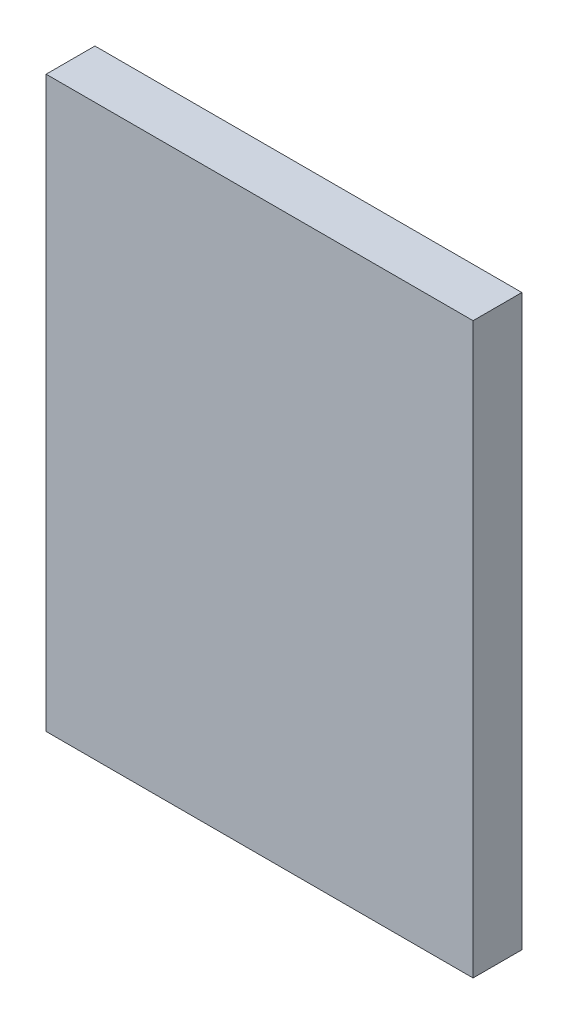
ISO-10303-21;
HEADER;
FILE_DESCRIPTION(('STEP AP214'),'2;1');
FILE_NAME('part.step','',(''),(''),'','','');
FILE_SCHEMA(('AUTOMOTIVE_DESIGN { 1 0 10303 214 1 1 1 1 }'));
ENDSEC;
DATA;
#1=APPLICATION_CONTEXT('core data for automotive mechanical design processes');
#2=APPLICATION_PROTOCOL_DEFINITION('international standard','automotive_design',2000,#1);
#3=PRODUCT_CONTEXT('',#1,'mechanical');
#4=PRODUCT('Part','Part','',(#3));
#5=PRODUCT_RELATED_PRODUCT_CATEGORY('part','',(#4));
#6=PRODUCT_DEFINITION_FORMATION('','',#4);
#7=PRODUCT_DEFINITION_CONTEXT('part definition',#1,'design');
#8=PRODUCT_DEFINITION('design','',#6,#7);
#9=PRODUCT_DEFINITION_SHAPE('','',#8);
#10=(LENGTH_UNIT() NAMED_UNIT(*) SI_UNIT(.MILLI.,.METRE.));
#11=(NAMED_UNIT(*) PLANE_ANGLE_UNIT() SI_UNIT($,.RADIAN.));
#12=(NAMED_UNIT(*) SI_UNIT($,.STERADIAN.) SOLID_ANGLE_UNIT());
#13=UNCERTAINTY_MEASURE_WITH_UNIT(LENGTH_MEASURE(1.E-05),#10,'distance_accuracy_value','');
#14=(GEOMETRIC_REPRESENTATION_CONTEXT(3) GLOBAL_UNCERTAINTY_ASSIGNED_CONTEXT((#13)) GLOBAL_UNIT_ASSIGNED_CONTEXT((#10,
#11,#12)) REPRESENTATION_CONTEXT('',''));
#15=CARTESIAN_POINT('',(0.,0.,0.));
#16=DIRECTION('',(0.,0.,1.));
#17=DIRECTION('',(1.,0.,0.));
#18=AXIS2_PLACEMENT_3D('',#15,#16,#17);
#19=CARTESIAN_POINT('',(6.9552,1.651,0.76487));
#20=DIRECTION('',(0.,0.,-1.));
#21=DIRECTION('',(-1.,0.,0.));
#22=AXIS2_PLACEMENT_3D('',#19,#20,#21);
#23=PLANE('',#22);
#24=DIRECTION('',(1.,0.,0.));
#25=VECTOR('',#24,1.);
#26=CARTESIAN_POINT('',(6.8052,1.851,0.76487));
#27=LINE('',#26,#25);
#28=CARTESIAN_POINT('',(6.8052,1.851,0.76487));
#29=VERTEX_POINT('',#28);
#30=CARTESIAN_POINT('',(7.1052,1.851,0.76487));
#31=VERTEX_POINT('',#30);
#32=EDGE_CURVE('E55',#29,#31,#27,.T.);
#33=ORIENTED_EDGE('',*,*,#32,.T.);
#34=DIRECTION('',(0.,1.,0.));
#35=VECTOR('',#34,1.);
#36=CARTESIAN_POINT('',(7.1052,1.851,0.76487));
#37=LINE('',#36,#35);
#38=CARTESIAN_POINT('',(7.1052,1.451,0.76487));
#39=VERTEX_POINT('',#38);
#40=EDGE_CURVE('E57',#31,#39,#37,.F.);
#41=ORIENTED_EDGE('',*,*,#40,.T.);
#42=DIRECTION('',(1.,0.,0.));
#43=VECTOR('',#42,1.);
#44=CARTESIAN_POINT('',(7.1052,1.451,0.76487));
#45=LINE('',#44,#43);
#46=CARTESIAN_POINT('',(6.8052,1.451,0.76487));
#47=VERTEX_POINT('',#46);
#48=EDGE_CURVE('E20',#39,#47,#45,.F.);
#49=ORIENTED_EDGE('',*,*,#48,.T.);
#50=DIRECTION('',(0.,1.,0.));
#51=VECTOR('',#50,1.);
#52=CARTESIAN_POINT('',(6.8052,1.451,0.76487));
#53=LINE('',#52,#51);
#54=EDGE_CURVE('E80',#47,#29,#53,.T.);
#55=ORIENTED_EDGE('',*,*,#54,.T.);
#56=EDGE_LOOP('',(#33,#41,#49,#55));
#57=FACE_BOUND('',#56,.T.);
#58=ADVANCED_FACE('F17',(#57),#23,.T.);
#59=CARTESIAN_POINT('',(7.1052,1.451,0.76487));
#60=DIRECTION('',(0.,1.,0.));
#61=DIRECTION('',(0.,0.,1.));
#62=AXIS2_PLACEMENT_3D('',#59,#60,#61);
#63=PLANE('',#62);
#64=DIRECTION('',(0.,0.,-1.));
#65=VECTOR('',#64,1.);
#66=CARTESIAN_POINT('',(6.8052,1.451,0.76487));
#67=LINE('',#66,#65);
#68=CARTESIAN_POINT('',(6.8052,1.451,0.79916));
#69=VERTEX_POINT('',#68);
#70=EDGE_CURVE('E68',#69,#47,#67,.T.);
#71=ORIENTED_EDGE('',*,*,#70,.T.);
#72=ORIENTED_EDGE('',*,*,#48,.F.);
#73=DIRECTION('',(0.,0.,1.));
#74=VECTOR('',#73,1.);
#75=CARTESIAN_POINT('',(7.1052,1.451,0.76487));
#76=LINE('',#75,#74);
#77=CARTESIAN_POINT('',(7.1052,1.451,0.79916));
#78=VERTEX_POINT('',#77);
#79=EDGE_CURVE('E63',#39,#78,#76,.T.);
#80=ORIENTED_EDGE('',*,*,#79,.T.);
#81=DIRECTION('',(1.,0.,0.));
#82=VECTOR('',#81,1.);
#83=CARTESIAN_POINT('',(6.9552,1.451,0.79916));
#84=LINE('',#83,#82);
#85=EDGE_CURVE('E83',#69,#78,#84,.T.);
#86=ORIENTED_EDGE('',*,*,#85,.F.);
#87=EDGE_LOOP('',(#71,#72,#80,#86));
#88=FACE_BOUND('',#87,.T.);
#89=ADVANCED_FACE('F65',(#88),#63,.F.);
#90=CARTESIAN_POINT('',(7.1052,1.851,0.76487));
#91=DIRECTION('',(-1.,0.,0.));
#92=DIRECTION('',(0.,0.,1.));
#93=AXIS2_PLACEMENT_3D('',#90,#91,#92);
#94=PLANE('',#93);
#95=ORIENTED_EDGE('',*,*,#79,.F.);
#96=ORIENTED_EDGE('',*,*,#40,.F.);
#97=DIRECTION('',(0.,0.,-1.));
#98=VECTOR('',#97,1.);
#99=CARTESIAN_POINT('',(7.1052,1.851,0.76487));
#100=LINE('',#99,#98);
#101=CARTESIAN_POINT('',(7.1052,1.851,0.79916));
#102=VERTEX_POINT('',#101);
#103=EDGE_CURVE('E75',#31,#102,#100,.F.);
#104=ORIENTED_EDGE('',*,*,#103,.T.);
#105=DIRECTION('',(0.,-1.,0.));
#106=VECTOR('',#105,1.);
#107=CARTESIAN_POINT('',(7.1052,1.651,0.79916));
#108=LINE('',#107,#106);
#109=EDGE_CURVE('E72',#78,#102,#108,.F.);
#110=ORIENTED_EDGE('',*,*,#109,.F.);
#111=EDGE_LOOP('',(#95,#96,#104,#110));
#112=FACE_BOUND('',#111,.T.);
#113=ADVANCED_FACE('F70',(#112),#94,.F.);
#114=CARTESIAN_POINT('',(6.8052,1.851,0.76487));
#115=DIRECTION('',(0.,-1.,0.));
#116=DIRECTION('',(0.,0.,-1.));
#117=AXIS2_PLACEMENT_3D('',#114,#115,#116);
#118=PLANE('',#117);
#119=ORIENTED_EDGE('',*,*,#103,.F.);
#120=ORIENTED_EDGE('',*,*,#32,.F.);
#121=DIRECTION('',(0.,0.,-1.));
#122=VECTOR('',#121,1.);
#123=CARTESIAN_POINT('',(6.8052,1.851,0.76487));
#124=LINE('',#123,#122);
#125=CARTESIAN_POINT('',(6.8052,1.851,0.79916));
#126=VERTEX_POINT('',#125);
#127=EDGE_CURVE('E35',#29,#126,#124,.F.);
#128=ORIENTED_EDGE('',*,*,#127,.T.);
#129=DIRECTION('',(1.,0.,0.));
#130=VECTOR('',#129,1.);
#131=CARTESIAN_POINT('',(6.9552,1.851,0.79916));
#132=LINE('',#131,#130);
#133=EDGE_CURVE('E26',#102,#126,#132,.F.);
#134=ORIENTED_EDGE('',*,*,#133,.F.);
#135=EDGE_LOOP('',(#119,#120,#128,#134));
#136=FACE_BOUND('',#135,.T.);
#137=ADVANCED_FACE('F89',(#136),#118,.F.);
#138=CARTESIAN_POINT('',(6.8052,1.451,0.76487));
#139=DIRECTION('',(1.,0.,0.));
#140=DIRECTION('',(0.,0.,-1.));
#141=AXIS2_PLACEMENT_3D('',#138,#139,#140);
#142=PLANE('',#141);
#143=ORIENTED_EDGE('',*,*,#127,.F.);
#144=ORIENTED_EDGE('',*,*,#54,.F.);
#145=ORIENTED_EDGE('',*,*,#70,.F.);
#146=DIRECTION('',(0.,-1.,0.));
#147=VECTOR('',#146,1.);
#148=CARTESIAN_POINT('',(6.8052,1.651,0.79916));
#149=LINE('',#148,#147);
#150=EDGE_CURVE('E11',#126,#69,#149,.T.);
#151=ORIENTED_EDGE('',*,*,#150,.F.);
#152=EDGE_LOOP('',(#143,#144,#145,#151));
#153=FACE_BOUND('',#152,.T.);
#154=ADVANCED_FACE('F91',(#153),#142,.F.);
#155=CARTESIAN_POINT('',(6.9552,1.651,0.79916));
#156=DIRECTION('',(0.,0.,1.));
#157=DIRECTION('',(0.,-1.,0.));
#158=AXIS2_PLACEMENT_3D('',#155,#156,#157);
#159=PLANE('',#158);
#160=ORIENTED_EDGE('',*,*,#133,.T.);
#161=ORIENTED_EDGE('',*,*,#150,.T.);
#162=ORIENTED_EDGE('',*,*,#85,.T.);
#163=ORIENTED_EDGE('',*,*,#109,.T.);
#164=EDGE_LOOP('',(#160,#161,#162,#163));
#165=FACE_BOUND('',#164,.T.);
#166=ADVANCED_FACE('F88',(#165),#159,.T.);
#167=CLOSED_SHELL('',(#58,#89,#113,#137,#154,#166));
#168=MANIFOLD_SOLID_BREP('B1',#167);
#169=ADVANCED_BREP_SHAPE_REPRESENTATION('',(#18,#168),#14);
#170=SHAPE_DEFINITION_REPRESENTATION(#9,#169);
ENDSEC;
END-ISO-10303-21;
